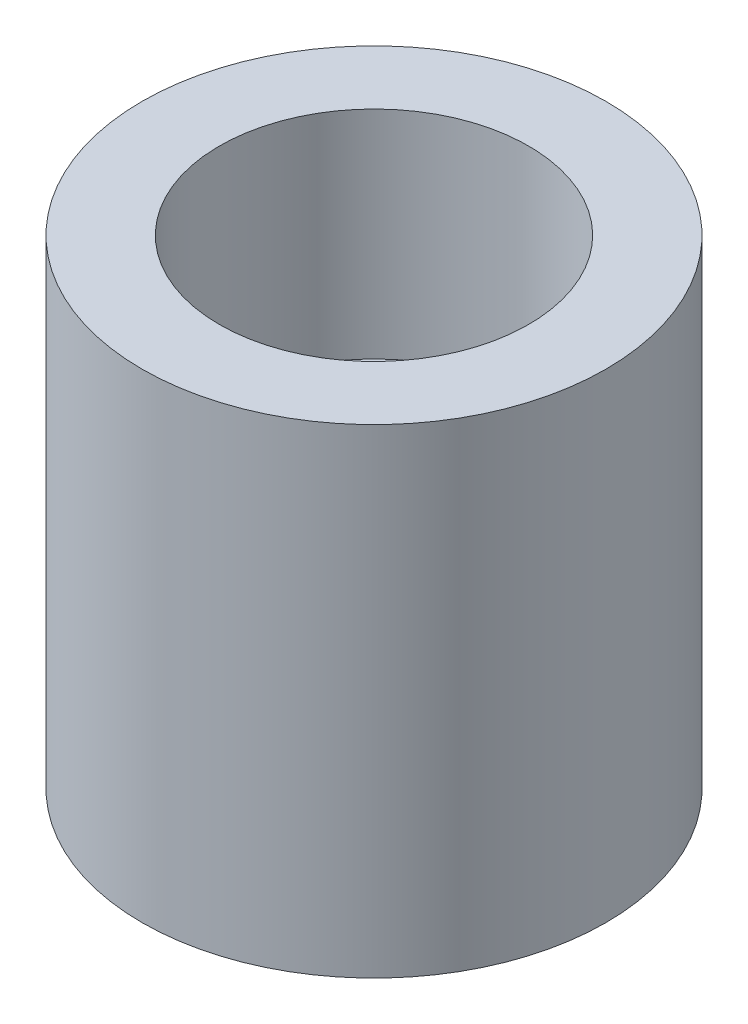
ISO-10303-21;
HEADER;
FILE_DESCRIPTION(('STEP AP214'),'2;1');
FILE_NAME('part.step','',(''),(''),'','','');
FILE_SCHEMA(('AUTOMOTIVE_DESIGN { 1 0 10303 214 1 1 1 1 }'));
ENDSEC;
DATA;
#1=APPLICATION_CONTEXT('core data for automotive mechanical design processes');
#2=APPLICATION_PROTOCOL_DEFINITION('international standard','automotive_design',2000,#1);
#3=PRODUCT_CONTEXT('',#1,'mechanical');
#4=PRODUCT('Part','Part','',(#3));
#5=PRODUCT_RELATED_PRODUCT_CATEGORY('part','',(#4));
#6=PRODUCT_DEFINITION_FORMATION('','',#4);
#7=PRODUCT_DEFINITION_CONTEXT('part definition',#1,'design');
#8=PRODUCT_DEFINITION('design','',#6,#7);
#9=PRODUCT_DEFINITION_SHAPE('','',#8);
#10=(LENGTH_UNIT() NAMED_UNIT(*) SI_UNIT(.MILLI.,.METRE.));
#11=(NAMED_UNIT(*) PLANE_ANGLE_UNIT() SI_UNIT($,.RADIAN.));
#12=(NAMED_UNIT(*) SI_UNIT($,.STERADIAN.) SOLID_ANGLE_UNIT());
#13=UNCERTAINTY_MEASURE_WITH_UNIT(LENGTH_MEASURE(1.E-05),#10,'distance_accuracy_value','');
#14=(GEOMETRIC_REPRESENTATION_CONTEXT(3) GLOBAL_UNCERTAINTY_ASSIGNED_CONTEXT((#13)) GLOBAL_UNIT_ASSIGNED_CONTEXT((#10,
#11,#12)) REPRESENTATION_CONTEXT('',''));
#15=CARTESIAN_POINT('',(0.,0.,0.));
#16=DIRECTION('',(0.,0.,1.));
#17=DIRECTION('',(1.,0.,0.));
#18=AXIS2_PLACEMENT_3D('',#15,#16,#17);
#19=CARTESIAN_POINT('',(0.,15.5,0.));
#20=DIRECTION('',(0.,-1.,0.));
#21=DIRECTION('',(0.,0.,-1.));
#22=AXIS2_PLACEMENT_3D('',#19,#20,#21);
#23=CYLINDRICAL_SURFACE('',#22,7.5);
#24=CARTESIAN_POINT('',(0.,15.5,0.));
#25=DIRECTION('',(0.,1.,0.));
#26=DIRECTION('',(0.,0.,1.));
#27=AXIS2_PLACEMENT_3D('',#24,#25,#26);
#28=CIRCLE('',#27,7.5);
#29=CARTESIAN_POINT('',(0.,15.5,7.5));
#30=VERTEX_POINT('',#29);
#31=EDGE_CURVE('E12',#30,#30,#28,.T.);
#32=ORIENTED_EDGE('',*,*,#31,.F.);
#33=EDGE_LOOP('',(#32));
#34=FACE_BOUND('',#33,.T.);
#35=CARTESIAN_POINT('',(0.,0.,0.));
#36=DIRECTION('',(0.,1.,0.));
#37=DIRECTION('',(0.,0.,1.));
#38=AXIS2_PLACEMENT_3D('',#35,#36,#37);
#39=CIRCLE('',#38,7.5);
#40=CARTESIAN_POINT('',(0.,0.,7.5));
#41=VERTEX_POINT('',#40);
#42=EDGE_CURVE('E48',#41,#41,#39,.T.);
#43=ORIENTED_EDGE('',*,*,#42,.T.);
#44=EDGE_LOOP('',(#43));
#45=FACE_BOUND('',#44,.T.);
#46=ADVANCED_FACE('F45',(#34,#45),#23,.T.);
#47=CARTESIAN_POINT('',(0.,15.5,0.));
#48=DIRECTION('',(0.,1.,0.));
#49=DIRECTION('',(0.,0.,1.));
#50=AXIS2_PLACEMENT_3D('',#47,#48,#49);
#51=PLANE('',#50);
#52=CARTESIAN_POINT('',(0.,15.5,0.));
#53=DIRECTION('',(0.,1.,0.));
#54=DIRECTION('',(0.,0.,1.));
#55=AXIS2_PLACEMENT_3D('',#52,#53,#54);
#56=CIRCLE('',#55,5.);
#57=CARTESIAN_POINT('',(0.,15.5,5.));
#58=VERTEX_POINT('',#57);
#59=EDGE_CURVE('E57',#58,#58,#56,.T.);
#60=ORIENTED_EDGE('',*,*,#59,.F.);
#61=EDGE_LOOP('',(#60));
#62=FACE_BOUND('',#61,.T.);
#63=ORIENTED_EDGE('',*,*,#31,.T.);
#64=EDGE_LOOP('',(#63));
#65=FACE_BOUND('',#64,.T.);
#66=ADVANCED_FACE('F72',(#62,#65),#51,.T.);
#67=CARTESIAN_POINT('',(0.,0.,0.));
#68=DIRECTION('',(0.,1.,0.));
#69=DIRECTION('',(0.,0.,1.));
#70=AXIS2_PLACEMENT_3D('',#67,#68,#69);
#71=PLANE('',#70);
#72=ORIENTED_EDGE('',*,*,#42,.F.);
#73=EDGE_LOOP('',(#72));
#74=FACE_BOUND('',#73,.T.);
#75=ADVANCED_FACE('F68',(#74),#71,.F.);
#76=CARTESIAN_POINT('',(0.,8.5,0.));
#77=DIRECTION('',(0.,1.,0.));
#78=DIRECTION('',(0.,0.,1.));
#79=AXIS2_PLACEMENT_3D('',#76,#77,#78);
#80=CYLINDRICAL_SURFACE('',#79,5.);
#81=CARTESIAN_POINT('',(0.,8.5,0.));
#82=DIRECTION('',(0.,1.,0.));
#83=DIRECTION('',(0.,0.,1.));
#84=AXIS2_PLACEMENT_3D('',#81,#82,#83);
#85=CIRCLE('',#84,5.);
#86=CARTESIAN_POINT('',(0.,8.5,5.));
#87=VERTEX_POINT('',#86);
#88=EDGE_CURVE('E55',#87,#87,#85,.T.);
#89=ORIENTED_EDGE('',*,*,#88,.F.);
#90=EDGE_LOOP('',(#89));
#91=FACE_BOUND('',#90,.T.);
#92=ORIENTED_EDGE('',*,*,#59,.T.);
#93=EDGE_LOOP('',(#92));
#94=FACE_BOUND('',#93,.T.);
#95=ADVANCED_FACE('F65',(#91,#94),#80,.F.);
#96=CARTESIAN_POINT('',(0.,8.5,0.));
#97=DIRECTION('',(0.,1.,0.));
#98=DIRECTION('',(0.,0.,1.));
#99=AXIS2_PLACEMENT_3D('',#96,#97,#98);
#100=PLANE('',#99);
#101=ORIENTED_EDGE('',*,*,#88,.T.);
#102=EDGE_LOOP('',(#101));
#103=FACE_BOUND('',#102,.T.);
#104=ADVANCED_FACE('F63',(#103),#100,.T.);
#105=CLOSED_SHELL('',(#46,#66,#75,#95,#104));
#106=MANIFOLD_SOLID_BREP('B2',#105);
#107=ADVANCED_BREP_SHAPE_REPRESENTATION('',(#18,#106),#14);
#108=SHAPE_DEFINITION_REPRESENTATION(#9,#107);
ENDSEC;
END-ISO-10303-21;
